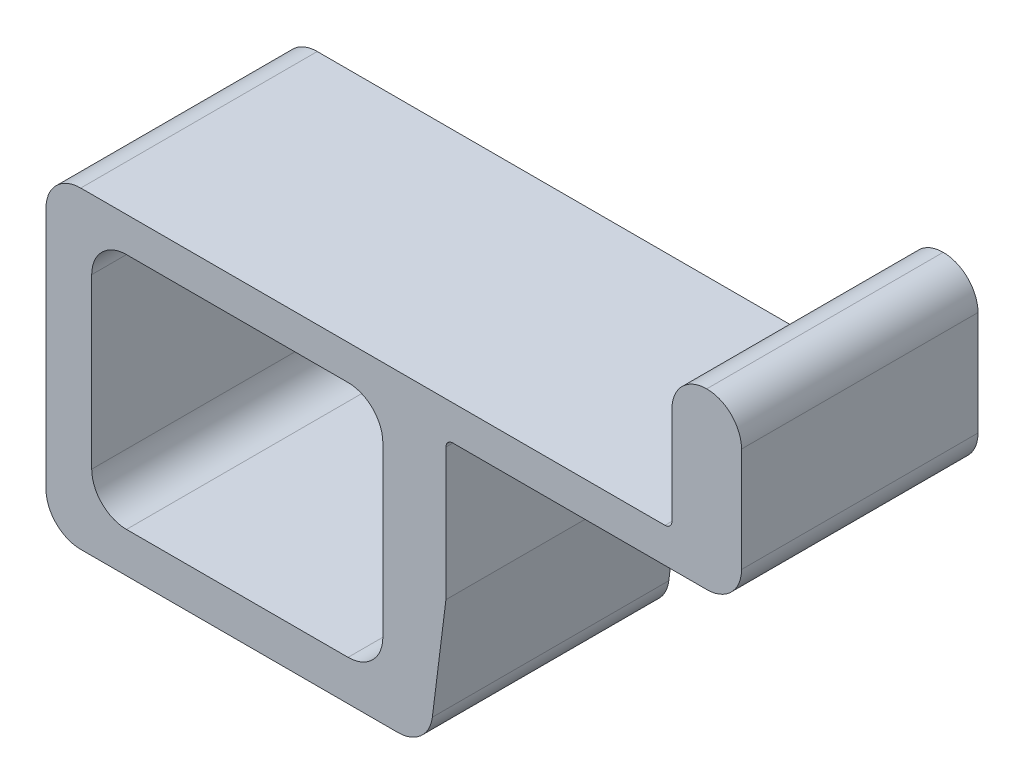
ISO-10303-21;
HEADER;
FILE_DESCRIPTION(('STEP AP214'),'2;1');
FILE_NAME('part.step','',(''),(''),'','','');
FILE_SCHEMA(('AUTOMOTIVE_DESIGN { 1 0 10303 214 1 1 1 1 }'));
ENDSEC;
DATA;
#1=APPLICATION_CONTEXT('core data for automotive mechanical design processes');
#2=APPLICATION_PROTOCOL_DEFINITION('international standard','automotive_design',2000,#1);
#3=PRODUCT_CONTEXT('',#1,'mechanical');
#4=PRODUCT('Part','Part','',(#3));
#5=PRODUCT_RELATED_PRODUCT_CATEGORY('part','',(#4));
#6=PRODUCT_DEFINITION_FORMATION('','',#4);
#7=PRODUCT_DEFINITION_CONTEXT('part definition',#1,'design');
#8=PRODUCT_DEFINITION('design','',#6,#7);
#9=PRODUCT_DEFINITION_SHAPE('','',#8);
#10=(LENGTH_UNIT() NAMED_UNIT(*) SI_UNIT(.MILLI.,.METRE.));
#11=(NAMED_UNIT(*) PLANE_ANGLE_UNIT() SI_UNIT($,.RADIAN.));
#12=(NAMED_UNIT(*) SI_UNIT($,.STERADIAN.) SOLID_ANGLE_UNIT());
#13=UNCERTAINTY_MEASURE_WITH_UNIT(LENGTH_MEASURE(1.E-05),#10,'distance_accuracy_value','');
#14=(GEOMETRIC_REPRESENTATION_CONTEXT(3) GLOBAL_UNCERTAINTY_ASSIGNED_CONTEXT((#13)) GLOBAL_UNIT_ASSIGNED_CONTEXT((#10,
#11,#12)) REPRESENTATION_CONTEXT('',''));
#15=CARTESIAN_POINT('',(0.,0.,0.));
#16=DIRECTION('',(0.,0.,1.));
#17=DIRECTION('',(1.,0.,0.));
#18=AXIS2_PLACEMENT_3D('',#15,#16,#17);
#19=CARTESIAN_POINT('',(13.9819004524887,0.,34.));
#20=DIRECTION('',(-1.,0.,0.));
#21=DIRECTION('',(0.,0.,1.));
#22=AXIS2_PLACEMENT_3D('',#19,#20,#21);
#23=PLANE('',#22);
#24=DIRECTION('',(0.,1.,0.));
#25=VECTOR('',#24,1.);
#26=CARTESIAN_POINT('',(13.9819004524887,0.,34.));
#27=LINE('',#26,#25);
#28=CARTESIAN_POINT('',(13.9819004524887,16.6108597285068,34.));
#29=VERTEX_POINT('',#28);
#30=CARTESIAN_POINT('',(13.9819004524887,30.6108597285068,34.));
#31=VERTEX_POINT('',#30);
#32=EDGE_CURVE('E391',#29,#31,#27,.T.);
#33=ORIENTED_EDGE('',*,*,#32,.T.);
#34=DIRECTION('',(0.,0.,-1.));
#35=VECTOR('',#34,1.);
#36=CARTESIAN_POINT('',(13.9819004524887,30.6108597285068,0.));
#37=LINE('',#36,#35);
#38=CARTESIAN_POINT('',(13.9819004524887,30.6108597285068,0.));
#39=VERTEX_POINT('',#38);
#40=EDGE_CURVE('E318',#31,#39,#37,.T.);
#41=ORIENTED_EDGE('',*,*,#40,.T.);
#42=DIRECTION('',(0.,1.,0.));
#43=VECTOR('',#42,1.);
#44=CARTESIAN_POINT('',(13.9819004524887,0.,0.));
#45=LINE('',#44,#43);
#46=CARTESIAN_POINT('',(13.9819004524887,16.6108597285068,0.));
#47=VERTEX_POINT('',#46);
#48=EDGE_CURVE('E244',#47,#39,#45,.T.);
#49=ORIENTED_EDGE('',*,*,#48,.F.);
#50=DIRECTION('',(0.,0.,-1.));
#51=VECTOR('',#50,1.);
#52=CARTESIAN_POINT('',(13.9819004524887,16.6108597285068,34.));
#53=LINE('',#52,#51);
#54=EDGE_CURVE('E267',#47,#29,#53,.F.);
#55=ORIENTED_EDGE('',*,*,#54,.T.);
#56=EDGE_LOOP('',(#33,#41,#49,#55));
#57=FACE_BOUND('',#56,.T.);
#58=ADVANCED_FACE('F35',(#57),#23,.T.);
#59=CARTESIAN_POINT('',(0.,15.6108597285068,34.));
#60=DIRECTION('',(0.,1.,0.));
#61=DIRECTION('',(0.,0.,1.));
#62=AXIS2_PLACEMENT_3D('',#59,#60,#61);
#63=PLANE('',#62);
#64=DIRECTION('',(1.,0.,0.));
#65=VECTOR('',#64,1.);
#66=CARTESIAN_POINT('',(0.,15.6108597285068,0.));
#67=LINE('',#66,#65);
#68=CARTESIAN_POINT('',(-71.0180995475113,15.6108597285068,0.));
#69=VERTEX_POINT('',#68);
#70=CARTESIAN_POINT('',(12.9819004524887,15.6108597285068,0.));
#71=VERTEX_POINT('',#70);
#72=EDGE_CURVE('E247',#69,#71,#67,.T.);
#73=ORIENTED_EDGE('',*,*,#72,.F.);
#74=DIRECTION('',(0.,0.,-1.));
#75=VECTOR('',#74,1.);
#76=CARTESIAN_POINT('',(-71.0180995475113,15.6108597285068,34.));
#77=LINE('',#76,#75);
#78=CARTESIAN_POINT('',(-71.0180995475113,15.6108597285068,34.));
#79=VERTEX_POINT('',#78);
#80=EDGE_CURVE('E354',#69,#79,#77,.F.);
#81=ORIENTED_EDGE('',*,*,#80,.T.);
#82=DIRECTION('',(1.,0.,0.));
#83=VECTOR('',#82,1.);
#84=CARTESIAN_POINT('',(0.,15.6108597285068,34.));
#85=LINE('',#84,#83);
#86=CARTESIAN_POINT('',(12.9819004524887,15.6108597285068,34.));
#87=VERTEX_POINT('',#86);
#88=EDGE_CURVE('E388',#79,#87,#85,.T.);
#89=ORIENTED_EDGE('',*,*,#88,.T.);
#90=DIRECTION('',(0.,0.,-1.));
#91=VECTOR('',#90,1.);
#92=CARTESIAN_POINT('',(12.9819004524887,15.6108597285068,0.));
#93=LINE('',#92,#91);
#94=EDGE_CURVE('E209',#87,#71,#93,.T.);
#95=ORIENTED_EDGE('',*,*,#94,.T.);
#96=EDGE_LOOP('',(#73,#81,#89,#95));
#97=FACE_BOUND('',#96,.T.);
#98=ADVANCED_FACE('F383',(#97),#63,.T.);
#99=CARTESIAN_POINT('',(-76.0180995475113,-4.21985222029471E-13,34.));
#100=DIRECTION('',(1.,0.,0.));
#101=DIRECTION('',(0.,1.,0.));
#102=AXIS2_PLACEMENT_3D('',#99,#100,#101);
#103=PLANE('',#102);
#104=DIRECTION('',(0.,-1.,0.));
#105=VECTOR('',#104,1.);
#106=CARTESIAN_POINT('',(-76.0180995475113,-4.21985222029471E-13,34.));
#107=LINE('',#106,#105);
#108=CARTESIAN_POINT('',(-76.0180995475113,10.6108597285068,34.));
#109=VERTEX_POINT('',#108);
#110=CARTESIAN_POINT('',(-76.0180995475111,-24.3891402714932,34.));
#111=VERTEX_POINT('',#110);
#112=EDGE_CURVE('E226',#109,#111,#107,.T.);
#113=ORIENTED_EDGE('',*,*,#112,.F.);
#114=DIRECTION('',(0.,0.,-1.));
#115=VECTOR('',#114,1.);
#116=CARTESIAN_POINT('',(-76.0180995475113,10.6108597285068,0.));
#117=LINE('',#116,#115);
#118=CARTESIAN_POINT('',(-76.0180995475113,10.6108597285068,0.));
#119=VERTEX_POINT('',#118);
#120=EDGE_CURVE('E351',#109,#119,#117,.T.);
#121=ORIENTED_EDGE('',*,*,#120,.T.);
#122=DIRECTION('',(0.,-1.,0.));
#123=VECTOR('',#122,1.);
#124=CARTESIAN_POINT('',(-76.0180995475113,-4.21985222029471E-13,0.));
#125=LINE('',#124,#123);
#126=CARTESIAN_POINT('',(-76.0180995475111,-24.3891402714932,0.));
#127=VERTEX_POINT('',#126);
#128=EDGE_CURVE('E249',#119,#127,#125,.T.);
#129=ORIENTED_EDGE('',*,*,#128,.T.);
#130=DIRECTION('',(0.,0.,-1.));
#131=VECTOR('',#130,1.);
#132=CARTESIAN_POINT('',(-76.0180995475111,-24.3891402714932,34.));
#133=LINE('',#132,#131);
#134=EDGE_CURVE('E349',#127,#111,#133,.F.);
#135=ORIENTED_EDGE('',*,*,#134,.T.);
#136=EDGE_LOOP('',(#113,#121,#129,#135));
#137=FACE_BOUND('',#136,.T.);
#138=ADVANCED_FACE('F376',(#137),#103,.F.);
#139=CARTESIAN_POINT('',(0.,-29.3891402714932,34.));
#140=DIRECTION('',(0.,1.,0.));
#141=DIRECTION('',(0.,0.,1.));
#142=AXIS2_PLACEMENT_3D('',#139,#140,#141);
#143=PLANE('',#142);
#144=DIRECTION('',(1.,0.,0.));
#145=VECTOR('',#144,1.);
#146=CARTESIAN_POINT('',(0.,-29.3891402714932,34.));
#147=LINE('',#146,#145);
#148=CARTESIAN_POINT('',(-71.0180995475111,-29.3891402714932,34.));
#149=VERTEX_POINT('',#148);
#150=CARTESIAN_POINT('',(-25.4320106401979,-29.3891402714932,34.));
#151=VERTEX_POINT('',#150);
#152=EDGE_CURVE('E224',#149,#151,#147,.T.);
#153=ORIENTED_EDGE('',*,*,#152,.F.);
#154=DIRECTION('',(0.,0.,-1.));
#155=VECTOR('',#154,1.);
#156=CARTESIAN_POINT('',(-71.0180995475111,-29.3891402714932,34.));
#157=LINE('',#156,#155);
#158=CARTESIAN_POINT('',(-71.0180995475111,-29.3891402714932,0.));
#159=VERTEX_POINT('',#158);
#160=EDGE_CURVE('E44',#149,#159,#157,.T.);
#161=ORIENTED_EDGE('',*,*,#160,.T.);
#162=DIRECTION('',(1.,0.,0.));
#163=VECTOR('',#162,1.);
#164=CARTESIAN_POINT('',(0.,-29.3891402714932,0.));
#165=LINE('',#164,#163);
#166=CARTESIAN_POINT('',(-25.4320106401979,-29.3891402714932,0.));
#167=VERTEX_POINT('',#166);
#168=EDGE_CURVE('E252',#159,#167,#165,.T.);
#169=ORIENTED_EDGE('',*,*,#168,.T.);
#170=DIRECTION('',(0.,0.,-1.));
#171=VECTOR('',#170,1.);
#172=CARTESIAN_POINT('',(-25.4320106401979,-29.3891402714932,34.));
#173=LINE('',#172,#171);
#174=EDGE_CURVE('E356',#167,#151,#173,.F.);
#175=ORIENTED_EDGE('',*,*,#174,.T.);
#176=EDGE_LOOP('',(#153,#161,#169,#175));
#177=FACE_BOUND('',#176,.T.);
#178=ADVANCED_FACE('F363',(#177),#143,.F.);
#179=CARTESIAN_POINT('',(-17.0776192133658,2.13470240167073,34.));
#180=DIRECTION('',(0.992277876713668,-0.124034734589209,0.));
#181=DIRECTION('',(0.124034734589209,0.992277876713668,0.));
#182=AXIS2_PLACEMENT_3D('',#179,#180,#181);
#183=PLANE('',#182);
#184=DIRECTION('',(-0.124034734589209,-0.992277876713668,0.));
#185=VECTOR('',#184,1.);
#186=CARTESIAN_POINT('',(-17.0776192133658,2.13470240167073,34.));
#187=LINE('',#186,#185);
#188=CARTESIAN_POINT('',(-18.5180995475113,-9.3891402714932,34.));
#189=VERTEX_POINT('',#188);
#190=CARTESIAN_POINT('',(-20.4706212566296,-25.0093139444392,34.));
#191=VERTEX_POINT('',#190);
#192=EDGE_CURVE('E202',#189,#191,#187,.T.);
#193=ORIENTED_EDGE('',*,*,#192,.T.);
#194=DIRECTION('',(0.,0.,-1.));
#195=VECTOR('',#194,1.);
#196=CARTESIAN_POINT('',(-20.4706212566296,-25.0093139444392,0.));
#197=LINE('',#196,#195);
#198=CARTESIAN_POINT('',(-20.4706212566296,-25.0093139444392,0.));
#199=VERTEX_POINT('',#198);
#200=EDGE_CURVE('E11',#191,#199,#197,.T.);
#201=ORIENTED_EDGE('',*,*,#200,.T.);
#202=DIRECTION('',(-0.124034734589209,-0.992277876713668,0.));
#203=VECTOR('',#202,1.);
#204=CARTESIAN_POINT('',(-17.0776192133658,2.13470240167073,0.));
#205=LINE('',#204,#203);
#206=CARTESIAN_POINT('',(-18.5180995475113,-9.3891402714932,0.));
#207=VERTEX_POINT('',#206);
#208=EDGE_CURVE('E205',#207,#199,#205,.T.);
#209=ORIENTED_EDGE('',*,*,#208,.F.);
#210=DIRECTION('',(0.,0.,-1.));
#211=VECTOR('',#210,1.);
#212=CARTESIAN_POINT('',(-18.5180995475113,-9.3891402714932,34.));
#213=LINE('',#212,#211);
#214=EDGE_CURVE('E198',#189,#207,#213,.T.);
#215=ORIENTED_EDGE('',*,*,#214,.F.);
#216=EDGE_LOOP('',(#193,#201,#209,#215));
#217=FACE_BOUND('',#216,.T.);
#218=ADVANCED_FACE('F200',(#217),#183,.T.);
#219=CARTESIAN_POINT('',(-18.5180995475113,0.,34.));
#220=DIRECTION('',(-1.,0.,0.));
#221=DIRECTION('',(0.,0.,1.));
#222=AXIS2_PLACEMENT_3D('',#219,#220,#221);
#223=PLANE('',#222);
#224=DIRECTION('',(0.,1.,0.));
#225=VECTOR('',#224,1.);
#226=CARTESIAN_POINT('',(-18.5180995475113,0.,0.));
#227=LINE('',#226,#225);
#228=CARTESIAN_POINT('',(-18.5180995475113,9.6108597285068,0.));
#229=VERTEX_POINT('',#228);
#230=EDGE_CURVE('E256',#207,#229,#227,.T.);
#231=ORIENTED_EDGE('',*,*,#230,.T.);
#232=DIRECTION('',(0.,0.,-1.));
#233=VECTOR('',#232,1.);
#234=CARTESIAN_POINT('',(-18.5180995475113,9.6108597285068,34.));
#235=LINE('',#234,#233);
#236=CARTESIAN_POINT('',(-18.5180995475113,9.6108597285068,34.));
#237=VERTEX_POINT('',#236);
#238=EDGE_CURVE('E216',#229,#237,#235,.F.);
#239=ORIENTED_EDGE('',*,*,#238,.T.);
#240=DIRECTION('',(0.,1.,0.));
#241=VECTOR('',#240,1.);
#242=CARTESIAN_POINT('',(-18.5180995475113,0.,34.));
#243=LINE('',#242,#241);
#244=EDGE_CURVE('E213',#189,#237,#243,.T.);
#245=ORIENTED_EDGE('',*,*,#244,.F.);
#246=ORIENTED_EDGE('',*,*,#214,.T.);
#247=EDGE_LOOP('',(#231,#239,#245,#246));
#248=FACE_BOUND('',#247,.T.);
#249=ADVANCED_FACE('F214',(#248),#223,.F.);
#250=CARTESIAN_POINT('',(0.,10.6108597285068,34.));
#251=DIRECTION('',(0.,1.,0.));
#252=DIRECTION('',(0.,0.,1.));
#253=AXIS2_PLACEMENT_3D('',#250,#251,#252);
#254=PLANE('',#253);
#255=DIRECTION('',(1.,0.,0.));
#256=VECTOR('',#255,1.);
#257=CARTESIAN_POINT('',(0.,10.6108597285068,0.));
#258=LINE('',#257,#256);
#259=CARTESIAN_POINT('',(-17.5180995475113,10.6108597285068,0.));
#260=VERTEX_POINT('',#259);
#261=CARTESIAN_POINT('',(18.9819004524886,10.6108597285068,0.));
#262=VERTEX_POINT('',#261);
#263=EDGE_CURVE('E258',#260,#262,#258,.T.);
#264=ORIENTED_EDGE('',*,*,#263,.T.);
#265=DIRECTION('',(0.,0.,-1.));
#266=VECTOR('',#265,1.);
#267=CARTESIAN_POINT('',(18.9819004524886,10.6108597285068,34.));
#268=LINE('',#267,#266);
#269=CARTESIAN_POINT('',(18.9819004524886,10.6108597285068,34.));
#270=VERTEX_POINT('',#269);
#271=EDGE_CURVE('E347',#262,#270,#268,.F.);
#272=ORIENTED_EDGE('',*,*,#271,.T.);
#273=DIRECTION('',(1.,0.,0.));
#274=VECTOR('',#273,1.);
#275=CARTESIAN_POINT('',(0.,10.6108597285068,34.));
#276=LINE('',#275,#274);
#277=CARTESIAN_POINT('',(-17.5180995475113,10.6108597285068,34.));
#278=VERTEX_POINT('',#277);
#279=EDGE_CURVE('E218',#278,#270,#276,.T.);
#280=ORIENTED_EDGE('',*,*,#279,.F.);
#281=DIRECTION('',(0.,0.,-1.));
#282=VECTOR('',#281,1.);
#283=CARTESIAN_POINT('',(-17.5180995475113,10.6108597285068,0.));
#284=LINE('',#283,#282);
#285=EDGE_CURVE('E269',#278,#260,#284,.T.);
#286=ORIENTED_EDGE('',*,*,#285,.T.);
#287=EDGE_LOOP('',(#264,#272,#280,#286));
#288=FACE_BOUND('',#287,.T.);
#289=ADVANCED_FACE('F553',(#288),#254,.F.);
#290=CARTESIAN_POINT('',(23.9819004524887,0.,34.));
#291=DIRECTION('',(1.,0.,0.));
#292=DIRECTION('',(0.,1.,0.));
#293=AXIS2_PLACEMENT_3D('',#290,#291,#292);
#294=PLANE('',#293);
#295=DIRECTION('',(0.,-1.,0.));
#296=VECTOR('',#295,1.);
#297=CARTESIAN_POINT('',(23.9819004524887,0.,0.));
#298=LINE('',#297,#296);
#299=CARTESIAN_POINT('',(23.9819004524886,30.6108597285068,0.));
#300=VERTEX_POINT('',#299);
#301=CARTESIAN_POINT('',(23.9819004524887,15.6108597285068,0.));
#302=VERTEX_POINT('',#301);
#303=EDGE_CURVE('E261',#300,#302,#298,.T.);
#304=ORIENTED_EDGE('',*,*,#303,.F.);
#305=DIRECTION('',(0.,0.,-1.));
#306=VECTOR('',#305,1.);
#307=CARTESIAN_POINT('',(23.9819004524886,30.6108597285068,34.));
#308=LINE('',#307,#306);
#309=CARTESIAN_POINT('',(23.9819004524886,30.6108597285068,34.));
#310=VERTEX_POINT('',#309);
#311=EDGE_CURVE('E345',#300,#310,#308,.F.);
#312=ORIENTED_EDGE('',*,*,#311,.T.);
#313=DIRECTION('',(0.,-1.,0.));
#314=VECTOR('',#313,1.);
#315=CARTESIAN_POINT('',(23.9819004524887,0.,34.));
#316=LINE('',#315,#314);
#317=CARTESIAN_POINT('',(23.9819004524887,15.6108597285068,34.));
#318=VERTEX_POINT('',#317);
#319=EDGE_CURVE('E210',#310,#318,#316,.T.);
#320=ORIENTED_EDGE('',*,*,#319,.T.);
#321=DIRECTION('',(0.,0.,-1.));
#322=VECTOR('',#321,1.);
#323=CARTESIAN_POINT('',(23.9819004524887,15.6108597285068,0.));
#324=LINE('',#323,#322);
#325=EDGE_CURVE('E342',#318,#302,#324,.T.);
#326=ORIENTED_EDGE('',*,*,#325,.T.);
#327=EDGE_LOOP('',(#304,#312,#320,#326));
#328=FACE_BOUND('',#327,.T.);
#329=ADVANCED_FACE('F468',(#328),#294,.T.);
#330=CARTESIAN_POINT('',(-27.5887073503891,0.,34.));
#331=DIRECTION('',(-1.,0.,0.));
#332=DIRECTION('',(0.,0.,1.));
#333=AXIS2_PLACEMENT_3D('',#330,#331,#332);
#334=PLANE('',#333);
#335=DIRECTION('',(0.,1.,0.));
#336=VECTOR('',#335,1.);
#337=CARTESIAN_POINT('',(-27.5887073503891,0.,0.));
#338=LINE('',#337,#336);
#339=CARTESIAN_POINT('',(-27.5887073503891,-18.6092868505313,0.));
#340=VERTEX_POINT('',#339);
#341=CARTESIAN_POINT('',(-27.5887073503891,5.6108597285068,0.));
#342=VERTEX_POINT('',#341);
#343=EDGE_CURVE('E232',#340,#342,#338,.T.);
#344=ORIENTED_EDGE('',*,*,#343,.F.);
#345=DIRECTION('',(0.,0.,-1.));
#346=VECTOR('',#345,1.);
#347=CARTESIAN_POINT('',(-27.5887073503891,-18.6092868505313,34.));
#348=LINE('',#347,#346);
#349=CARTESIAN_POINT('',(-27.5887073503891,-18.6092868505313,34.));
#350=VERTEX_POINT('',#349);
#351=EDGE_CURVE('E295',#340,#350,#348,.F.);
#352=ORIENTED_EDGE('',*,*,#351,.T.);
#353=DIRECTION('',(0.,1.,0.));
#354=VECTOR('',#353,1.);
#355=CARTESIAN_POINT('',(-27.5887073503891,0.,34.));
#356=LINE('',#355,#354);
#357=CARTESIAN_POINT('',(-27.5887073503891,5.6108597285068,34.));
#358=VERTEX_POINT('',#357);
#359=EDGE_CURVE('E263',#350,#358,#356,.T.);
#360=ORIENTED_EDGE('',*,*,#359,.T.);
#361=DIRECTION('',(0.,0.,-1.));
#362=VECTOR('',#361,1.);
#363=CARTESIAN_POINT('',(-27.5887073503891,5.6108597285068,34.));
#364=LINE('',#363,#362);
#365=EDGE_CURVE('E292',#358,#342,#364,.T.);
#366=ORIENTED_EDGE('',*,*,#365,.T.);
#367=EDGE_LOOP('',(#344,#352,#360,#366));
#368=FACE_BOUND('',#367,.T.);
#369=ADVANCED_FACE('F410',(#368),#334,.T.);
#370=CARTESIAN_POINT('',(0.,-23.6092868505313,34.));
#371=DIRECTION('',(0.,1.,0.));
#372=DIRECTION('',(0.,0.,1.));
#373=AXIS2_PLACEMENT_3D('',#370,#371,#372);
#374=PLANE('',#373);
#375=DIRECTION('',(1.,0.,0.));
#376=VECTOR('',#375,1.);
#377=CARTESIAN_POINT('',(0.,-23.6092868505313,0.));
#378=LINE('',#377,#376);
#379=CARTESIAN_POINT('',(-64.4474917446336,-23.6092868505313,0.));
#380=VERTEX_POINT('',#379);
#381=CARTESIAN_POINT('',(-32.5887073503891,-23.6092868505313,0.));
#382=VERTEX_POINT('',#381);
#383=EDGE_CURVE('E235',#380,#382,#378,.T.);
#384=ORIENTED_EDGE('',*,*,#383,.F.);
#385=DIRECTION('',(0.,0.,-1.));
#386=VECTOR('',#385,1.);
#387=CARTESIAN_POINT('',(-64.4474917446336,-23.6092868505313,34.));
#388=LINE('',#387,#386);
#389=CARTESIAN_POINT('',(-64.4474917446336,-23.6092868505313,34.));
#390=VERTEX_POINT('',#389);
#391=EDGE_CURVE('E290',#380,#390,#388,.F.);
#392=ORIENTED_EDGE('',*,*,#391,.T.);
#393=DIRECTION('',(1.,0.,0.));
#394=VECTOR('',#393,1.);
#395=CARTESIAN_POINT('',(0.,-23.6092868505313,34.));
#396=LINE('',#395,#394);
#397=CARTESIAN_POINT('',(-32.5887073503891,-23.6092868505313,34.));
#398=VERTEX_POINT('',#397);
#399=EDGE_CURVE('E402',#390,#398,#396,.T.);
#400=ORIENTED_EDGE('',*,*,#399,.T.);
#401=DIRECTION('',(0.,0.,-1.));
#402=VECTOR('',#401,1.);
#403=CARTESIAN_POINT('',(-32.5887073503891,-23.6092868505313,0.));
#404=LINE('',#403,#402);
#405=EDGE_CURVE('E287',#398,#382,#404,.T.);
#406=ORIENTED_EDGE('',*,*,#405,.T.);
#407=EDGE_LOOP('',(#384,#392,#400,#406));
#408=FACE_BOUND('',#407,.T.);
#409=ADVANCED_FACE('F439',(#408),#374,.T.);
#410=CARTESIAN_POINT('',(-69.4474917446336,0.,34.));
#411=DIRECTION('',(-1.,0.,0.));
#412=DIRECTION('',(0.,0.,1.));
#413=AXIS2_PLACEMENT_3D('',#410,#411,#412);
#414=PLANE('',#413);
#415=DIRECTION('',(0.,1.,0.));
#416=VECTOR('',#415,1.);
#417=CARTESIAN_POINT('',(-69.4474917446336,0.,34.));
#418=LINE('',#417,#416);
#419=CARTESIAN_POINT('',(-69.4474917446336,-18.6092868505313,34.));
#420=VERTEX_POINT('',#419);
#421=CARTESIAN_POINT('',(-69.4474917446336,5.6108597285068,34.));
#422=VERTEX_POINT('',#421);
#423=EDGE_CURVE('E399',#420,#422,#418,.T.);
#424=ORIENTED_EDGE('',*,*,#423,.F.);
#425=DIRECTION('',(0.,0.,-1.));
#426=VECTOR('',#425,1.);
#427=CARTESIAN_POINT('',(-69.4474917446336,-18.6092868505313,34.));
#428=LINE('',#427,#426);
#429=CARTESIAN_POINT('',(-69.4474917446336,-18.6092868505313,0.));
#430=VERTEX_POINT('',#429);
#431=EDGE_CURVE('E284',#420,#430,#428,.T.);
#432=ORIENTED_EDGE('',*,*,#431,.T.);
#433=DIRECTION('',(0.,1.,0.));
#434=VECTOR('',#433,1.);
#435=CARTESIAN_POINT('',(-69.4474917446336,0.,0.));
#436=LINE('',#435,#434);
#437=CARTESIAN_POINT('',(-69.4474917446336,5.6108597285068,0.));
#438=VERTEX_POINT('',#437);
#439=EDGE_CURVE('E238',#430,#438,#436,.T.);
#440=ORIENTED_EDGE('',*,*,#439,.T.);
#441=DIRECTION('',(0.,0.,-1.));
#442=VECTOR('',#441,1.);
#443=CARTESIAN_POINT('',(-69.4474917446336,5.6108597285068,34.));
#444=LINE('',#443,#442);
#445=EDGE_CURVE('E282',#438,#422,#444,.F.);
#446=ORIENTED_EDGE('',*,*,#445,.T.);
#447=EDGE_LOOP('',(#424,#432,#440,#446));
#448=FACE_BOUND('',#447,.T.);
#449=ADVANCED_FACE('F431',(#448),#414,.F.);
#450=CARTESIAN_POINT('',(0.,10.6108597285068,34.));
#451=DIRECTION('',(0.,1.,0.));
#452=DIRECTION('',(0.,0.,1.));
#453=AXIS2_PLACEMENT_3D('',#450,#451,#452);
#454=PLANE('',#453);
#455=DIRECTION('',(1.,0.,0.));
#456=VECTOR('',#455,1.);
#457=CARTESIAN_POINT('',(0.,10.6108597285068,0.));
#458=LINE('',#457,#456);
#459=CARTESIAN_POINT('',(-64.4474917446336,10.6108597285068,0.));
#460=VERTEX_POINT('',#459);
#461=CARTESIAN_POINT('',(-32.5887073503891,10.6108597285068,0.));
#462=VERTEX_POINT('',#461);
#463=EDGE_CURVE('E241',#460,#462,#458,.T.);
#464=ORIENTED_EDGE('',*,*,#463,.T.);
#465=DIRECTION('',(0.,0.,-1.));
#466=VECTOR('',#465,1.);
#467=CARTESIAN_POINT('',(-32.5887073503891,10.6108597285068,34.));
#468=LINE('',#467,#466);
#469=CARTESIAN_POINT('',(-32.5887073503891,10.6108597285068,34.));
#470=VERTEX_POINT('',#469);
#471=EDGE_CURVE('E300',#462,#470,#468,.F.);
#472=ORIENTED_EDGE('',*,*,#471,.T.);
#473=DIRECTION('',(1.,0.,0.));
#474=VECTOR('',#473,1.);
#475=CARTESIAN_POINT('',(0.,10.6108597285068,34.));
#476=LINE('',#475,#474);
#477=CARTESIAN_POINT('',(-64.4474917446336,10.6108597285068,34.));
#478=VERTEX_POINT('',#477);
#479=EDGE_CURVE('E394',#478,#470,#476,.T.);
#480=ORIENTED_EDGE('',*,*,#479,.F.);
#481=DIRECTION('',(0.,0.,-1.));
#482=VECTOR('',#481,1.);
#483=CARTESIAN_POINT('',(-64.4474917446336,10.6108597285068,0.));
#484=LINE('',#483,#482);
#485=EDGE_CURVE('E297',#478,#460,#484,.T.);
#486=ORIENTED_EDGE('',*,*,#485,.T.);
#487=EDGE_LOOP('',(#464,#472,#480,#486));
#488=FACE_BOUND('',#487,.T.);
#489=ADVANCED_FACE('F421',(#488),#454,.F.);
#490=CARTESIAN_POINT('',(0.,0.,34.));
#491=DIRECTION('',(0.,0.,1.));
#492=DIRECTION('',(1.,0.,0.));
#493=AXIS2_PLACEMENT_3D('',#490,#491,#492);
#494=PLANE('',#493);
#495=ORIENTED_EDGE('',*,*,#359,.F.);
#496=CARTESIAN_POINT('',(-32.5887073503891,-18.6092868505313,34.));
#497=DIRECTION('',(0.,0.,1.));
#498=DIRECTION('',(1.,0.,0.));
#499=AXIS2_PLACEMENT_3D('',#496,#497,#498);
#500=CIRCLE('',#499,5.);
#501=EDGE_CURVE('E308',#350,#398,#500,.F.);
#502=ORIENTED_EDGE('',*,*,#501,.T.);
#503=ORIENTED_EDGE('',*,*,#399,.F.);
#504=CARTESIAN_POINT('',(-64.4474917446336,-18.6092868505313,34.));
#505=DIRECTION('',(0.,0.,1.));
#506=DIRECTION('',(1.,0.,0.));
#507=AXIS2_PLACEMENT_3D('',#504,#505,#506);
#508=CIRCLE('',#507,5.);
#509=EDGE_CURVE('E304',#390,#420,#508,.F.);
#510=ORIENTED_EDGE('',*,*,#509,.T.);
#511=ORIENTED_EDGE('',*,*,#423,.T.);
#512=CARTESIAN_POINT('',(-64.4474917446336,5.6108597285068,34.));
#513=DIRECTION('',(0.,0.,1.));
#514=DIRECTION('',(1.,0.,0.));
#515=AXIS2_PLACEMENT_3D('',#512,#513,#514);
#516=CIRCLE('',#515,5.);
#517=EDGE_CURVE('E316',#422,#478,#516,.F.);
#518=ORIENTED_EDGE('',*,*,#517,.T.);
#519=ORIENTED_EDGE('',*,*,#479,.T.);
#520=CARTESIAN_POINT('',(-32.5887073503891,5.6108597285068,34.));
#521=DIRECTION('',(0.,0.,1.));
#522=DIRECTION('',(1.,0.,0.));
#523=AXIS2_PLACEMENT_3D('',#520,#521,#522);
#524=CIRCLE('',#523,5.);
#525=EDGE_CURVE('E312',#470,#358,#524,.F.);
#526=ORIENTED_EDGE('',*,*,#525,.T.);
#527=EDGE_LOOP('',(#495,#502,#503,#510,#511,#518,#519,#526));
#528=FACE_BOUND('',#527,.T.);
#529=CARTESIAN_POINT('',(18.9819004524886,30.6108597285068,34.));
#530=DIRECTION('',(0.,0.,1.));
#531=DIRECTION('',(1.,0.,0.));
#532=AXIS2_PLACEMENT_3D('',#529,#530,#531);
#533=CIRCLE('',#532,5.);
#534=CARTESIAN_POINT('',(18.9819004524886,35.6108597285068,34.));
#535=VERTEX_POINT('',#534);
#536=EDGE_CURVE('E51',#310,#535,#533,.T.);
#537=ORIENTED_EDGE('',*,*,#536,.T.);
#538=CARTESIAN_POINT('',(18.9819004524886,30.6108597285068,34.));
#539=DIRECTION('',(0.,0.,1.));
#540=DIRECTION('',(1.,0.,0.));
#541=AXIS2_PLACEMENT_3D('',#538,#539,#540);
#542=CIRCLE('',#541,5.);
#543=EDGE_CURVE('E340',#535,#31,#542,.T.);
#544=ORIENTED_EDGE('',*,*,#543,.T.);
#545=ORIENTED_EDGE('',*,*,#32,.F.);
#546=CARTESIAN_POINT('',(12.9819004524887,16.6108597285068,34.));
#547=DIRECTION('',(0.,0.,1.));
#548=DIRECTION('',(1.,0.,0.));
#549=AXIS2_PLACEMENT_3D('',#546,#547,#548);
#550=CIRCLE('',#549,1.);
#551=EDGE_CURVE('E275',#29,#87,#550,.F.);
#552=ORIENTED_EDGE('',*,*,#551,.T.);
#553=ORIENTED_EDGE('',*,*,#88,.F.);
#554=CARTESIAN_POINT('',(-71.0180995475113,10.6108597285068,34.));
#555=DIRECTION('',(0.,0.,1.));
#556=DIRECTION('',(1.,0.,0.));
#557=AXIS2_PLACEMENT_3D('',#554,#555,#556);
#558=CIRCLE('',#557,5.);
#559=EDGE_CURVE('E336',#79,#109,#558,.T.);
#560=ORIENTED_EDGE('',*,*,#559,.T.);
#561=ORIENTED_EDGE('',*,*,#112,.T.);
#562=CARTESIAN_POINT('',(-71.0180995475111,-24.3891402714932,34.));
#563=DIRECTION('',(0.,0.,1.));
#564=DIRECTION('',(1.,0.,0.));
#565=AXIS2_PLACEMENT_3D('',#562,#563,#564);
#566=CIRCLE('',#565,5.);
#567=EDGE_CURVE('E334',#111,#149,#566,.T.);
#568=ORIENTED_EDGE('',*,*,#567,.T.);
#569=ORIENTED_EDGE('',*,*,#152,.T.);
#570=CARTESIAN_POINT('',(-25.4320106401979,-24.3891402714932,34.));
#571=DIRECTION('',(0.,0.,1.));
#572=DIRECTION('',(1.,0.,0.));
#573=AXIS2_PLACEMENT_3D('',#570,#571,#572);
#574=CIRCLE('',#573,5.);
#575=EDGE_CURVE('E223',#151,#191,#574,.T.);
#576=ORIENTED_EDGE('',*,*,#575,.T.);
#577=ORIENTED_EDGE('',*,*,#192,.F.);
#578=ORIENTED_EDGE('',*,*,#244,.T.);
#579=CARTESIAN_POINT('',(-17.5180995475113,9.6108597285068,34.));
#580=DIRECTION('',(0.,0.,1.));
#581=DIRECTION('',(1.,0.,0.));
#582=AXIS2_PLACEMENT_3D('',#579,#580,#581);
#583=CIRCLE('',#582,1.);
#584=EDGE_CURVE('E280',#237,#278,#583,.F.);
#585=ORIENTED_EDGE('',*,*,#584,.T.);
#586=ORIENTED_EDGE('',*,*,#279,.T.);
#587=CARTESIAN_POINT('',(18.9819004524886,15.6108597285068,34.));
#588=DIRECTION('',(0.,0.,1.));
#589=DIRECTION('',(1.,0.,0.));
#590=AXIS2_PLACEMENT_3D('',#587,#588,#589);
#591=CIRCLE('',#590,5.);
#592=EDGE_CURVE('E57',#270,#318,#591,.T.);
#593=ORIENTED_EDGE('',*,*,#592,.T.);
#594=ORIENTED_EDGE('',*,*,#319,.F.);
#595=EDGE_LOOP('',(#537,#544,#545,#552,#553,#560,#561,#568,#569,#576,#577,#578,#585,#586,#593,#594));
#596=FACE_BOUND('',#595,.T.);
#597=ADVANCED_FACE('F220',(#528,#596),#494,.T.);
#598=CARTESIAN_POINT('',(0.,0.,0.));
#599=DIRECTION('',(0.,0.,1.));
#600=DIRECTION('',(1.,0.,0.));
#601=AXIS2_PLACEMENT_3D('',#598,#599,#600);
#602=PLANE('',#601);
#603=ORIENTED_EDGE('',*,*,#383,.T.);
#604=CARTESIAN_POINT('',(-32.5887073503891,-18.6092868505313,0.));
#605=DIRECTION('',(0.,0.,1.));
#606=DIRECTION('',(1.,0.,0.));
#607=AXIS2_PLACEMENT_3D('',#604,#605,#606);
#608=CIRCLE('',#607,5.);
#609=EDGE_CURVE('E306',#382,#340,#608,.T.);
#610=ORIENTED_EDGE('',*,*,#609,.T.);
#611=ORIENTED_EDGE('',*,*,#343,.T.);
#612=CARTESIAN_POINT('',(-32.5887073503891,5.6108597285068,0.));
#613=DIRECTION('',(0.,0.,1.));
#614=DIRECTION('',(1.,0.,0.));
#615=AXIS2_PLACEMENT_3D('',#612,#613,#614);
#616=CIRCLE('',#615,5.);
#617=EDGE_CURVE('E310',#342,#462,#616,.T.);
#618=ORIENTED_EDGE('',*,*,#617,.T.);
#619=ORIENTED_EDGE('',*,*,#463,.F.);
#620=CARTESIAN_POINT('',(-64.4474917446336,5.6108597285068,0.));
#621=DIRECTION('',(0.,0.,1.));
#622=DIRECTION('',(1.,0.,0.));
#623=AXIS2_PLACEMENT_3D('',#620,#621,#622);
#624=CIRCLE('',#623,5.);
#625=EDGE_CURVE('E314',#460,#438,#624,.T.);
#626=ORIENTED_EDGE('',*,*,#625,.T.);
#627=ORIENTED_EDGE('',*,*,#439,.F.);
#628=CARTESIAN_POINT('',(-64.4474917446336,-18.6092868505313,0.));
#629=DIRECTION('',(0.,0.,1.));
#630=DIRECTION('',(1.,0.,0.));
#631=AXIS2_PLACEMENT_3D('',#628,#629,#630);
#632=CIRCLE('',#631,5.);
#633=EDGE_CURVE('E302',#430,#380,#632,.T.);
#634=ORIENTED_EDGE('',*,*,#633,.T.);
#635=EDGE_LOOP('',(#603,#610,#611,#618,#619,#626,#627,#634));
#636=FACE_BOUND('',#635,.T.);
#637=ORIENTED_EDGE('',*,*,#48,.T.);
#638=CARTESIAN_POINT('',(18.9819004524886,30.6108597285068,0.));
#639=DIRECTION('',(0.,0.,1.));
#640=DIRECTION('',(1.,0.,0.));
#641=AXIS2_PLACEMENT_3D('',#638,#639,#640);
#642=CIRCLE('',#641,5.);
#643=CARTESIAN_POINT('',(18.9819004524886,35.6108597285068,0.));
#644=VERTEX_POINT('',#643);
#645=EDGE_CURVE('E331',#39,#644,#642,.F.);
#646=ORIENTED_EDGE('',*,*,#645,.T.);
#647=CARTESIAN_POINT('',(18.9819004524886,30.6108597285068,0.));
#648=DIRECTION('',(0.,0.,1.));
#649=DIRECTION('',(1.,0.,0.));
#650=AXIS2_PLACEMENT_3D('',#647,#648,#649);
#651=CIRCLE('',#650,5.);
#652=EDGE_CURVE('E329',#644,#300,#651,.F.);
#653=ORIENTED_EDGE('',*,*,#652,.T.);
#654=ORIENTED_EDGE('',*,*,#303,.T.);
#655=CARTESIAN_POINT('',(18.9819004524886,15.6108597285068,0.));
#656=DIRECTION('',(0.,0.,1.));
#657=DIRECTION('',(1.,0.,0.));
#658=AXIS2_PLACEMENT_3D('',#655,#656,#657);
#659=CIRCLE('',#658,5.);
#660=EDGE_CURVE('E327',#302,#262,#659,.F.);
#661=ORIENTED_EDGE('',*,*,#660,.T.);
#662=ORIENTED_EDGE('',*,*,#263,.F.);
#663=CARTESIAN_POINT('',(-17.5180995475113,9.6108597285068,0.));
#664=DIRECTION('',(0.,0.,1.));
#665=DIRECTION('',(1.,0.,0.));
#666=AXIS2_PLACEMENT_3D('',#663,#664,#665);
#667=CIRCLE('',#666,1.);
#668=EDGE_CURVE('E278',#260,#229,#667,.T.);
#669=ORIENTED_EDGE('',*,*,#668,.T.);
#670=ORIENTED_EDGE('',*,*,#230,.F.);
#671=ORIENTED_EDGE('',*,*,#208,.T.);
#672=CARTESIAN_POINT('',(-25.4320106401979,-24.3891402714932,0.));
#673=DIRECTION('',(0.,0.,1.));
#674=DIRECTION('',(1.,0.,0.));
#675=AXIS2_PLACEMENT_3D('',#672,#673,#674);
#676=CIRCLE('',#675,5.);
#677=EDGE_CURVE('E321',#199,#167,#676,.F.);
#678=ORIENTED_EDGE('',*,*,#677,.T.);
#679=ORIENTED_EDGE('',*,*,#168,.F.);
#680=CARTESIAN_POINT('',(-71.0180995475111,-24.3891402714932,0.));
#681=DIRECTION('',(0.,0.,1.));
#682=DIRECTION('',(1.,0.,0.));
#683=AXIS2_PLACEMENT_3D('',#680,#681,#682);
#684=CIRCLE('',#683,5.);
#685=EDGE_CURVE('E323',#159,#127,#684,.F.);
#686=ORIENTED_EDGE('',*,*,#685,.T.);
#687=ORIENTED_EDGE('',*,*,#128,.F.);
#688=CARTESIAN_POINT('',(-71.0180995475113,10.6108597285068,0.));
#689=DIRECTION('',(0.,0.,1.));
#690=DIRECTION('',(1.,0.,0.));
#691=AXIS2_PLACEMENT_3D('',#688,#689,#690);
#692=CIRCLE('',#691,5.);
#693=EDGE_CURVE('E325',#119,#69,#692,.F.);
#694=ORIENTED_EDGE('',*,*,#693,.T.);
#695=ORIENTED_EDGE('',*,*,#72,.T.);
#696=CARTESIAN_POINT('',(12.9819004524887,16.6108597285068,0.));
#697=DIRECTION('',(0.,0.,1.));
#698=DIRECTION('',(1.,0.,0.));
#699=AXIS2_PLACEMENT_3D('',#696,#697,#698);
#700=CIRCLE('',#699,1.);
#701=EDGE_CURVE('E273',#71,#47,#700,.T.);
#702=ORIENTED_EDGE('',*,*,#701,.T.);
#703=EDGE_LOOP('',(#637,#646,#653,#654,#661,#662,#669,#670,#671,#678,#679,#686,#687,#694,#695,#702));
#704=FACE_BOUND('',#703,.T.);
#705=ADVANCED_FACE('F368',(#636,#704),#602,.F.);
#706=CARTESIAN_POINT('',(12.9819004524887,16.6108597285068,34.));
#707=DIRECTION('',(0.,0.,1.));
#708=DIRECTION('',(1.,0.,0.));
#709=AXIS2_PLACEMENT_3D('',#706,#707,#708);
#710=CYLINDRICAL_SURFACE('',#709,1.);
#711=ORIENTED_EDGE('',*,*,#551,.F.);
#712=ORIENTED_EDGE('',*,*,#54,.F.);
#713=ORIENTED_EDGE('',*,*,#701,.F.);
#714=ORIENTED_EDGE('',*,*,#94,.F.);
#715=EDGE_LOOP('',(#711,#712,#713,#714));
#716=FACE_BOUND('',#715,.T.);
#717=ADVANCED_FACE('F450',(#716),#710,.F.);
#718=CARTESIAN_POINT('',(-17.5180995475113,9.6108597285068,34.));
#719=DIRECTION('',(0.,0.,1.));
#720=DIRECTION('',(1.,0.,0.));
#721=AXIS2_PLACEMENT_3D('',#718,#719,#720);
#722=CYLINDRICAL_SURFACE('',#721,1.);
#723=ORIENTED_EDGE('',*,*,#584,.F.);
#724=ORIENTED_EDGE('',*,*,#238,.F.);
#725=ORIENTED_EDGE('',*,*,#668,.F.);
#726=ORIENTED_EDGE('',*,*,#285,.F.);
#727=EDGE_LOOP('',(#723,#724,#725,#726));
#728=FACE_BOUND('',#727,.T.);
#729=ADVANCED_FACE('F471',(#728),#722,.F.);
#730=CARTESIAN_POINT('',(-64.4474917446336,-18.6092868505313,34.));
#731=DIRECTION('',(0.,0.,-1.));
#732=DIRECTION('',(-1.,0.,0.));
#733=AXIS2_PLACEMENT_3D('',#730,#731,#732);
#734=CYLINDRICAL_SURFACE('',#733,5.);
#735=ORIENTED_EDGE('',*,*,#509,.F.);
#736=ORIENTED_EDGE('',*,*,#391,.F.);
#737=ORIENTED_EDGE('',*,*,#633,.F.);
#738=ORIENTED_EDGE('',*,*,#431,.F.);
#739=EDGE_LOOP('',(#735,#736,#737,#738));
#740=FACE_BOUND('',#739,.T.);
#741=ADVANCED_FACE('F435',(#740),#734,.F.);
#742=CARTESIAN_POINT('',(-32.5887073503891,-18.6092868505313,34.));
#743=DIRECTION('',(0.,0.,1.));
#744=DIRECTION('',(1.,0.,0.));
#745=AXIS2_PLACEMENT_3D('',#742,#743,#744);
#746=CYLINDRICAL_SURFACE('',#745,5.);
#747=ORIENTED_EDGE('',*,*,#501,.F.);
#748=ORIENTED_EDGE('',*,*,#351,.F.);
#749=ORIENTED_EDGE('',*,*,#609,.F.);
#750=ORIENTED_EDGE('',*,*,#405,.F.);
#751=EDGE_LOOP('',(#747,#748,#749,#750));
#752=FACE_BOUND('',#751,.T.);
#753=ADVANCED_FACE('F443',(#752),#746,.F.);
#754=CARTESIAN_POINT('',(-32.5887073503891,5.6108597285068,34.));
#755=DIRECTION('',(0.,0.,-1.));
#756=DIRECTION('',(-1.,0.,0.));
#757=AXIS2_PLACEMENT_3D('',#754,#755,#756);
#758=CYLINDRICAL_SURFACE('',#757,5.);
#759=ORIENTED_EDGE('',*,*,#525,.F.);
#760=ORIENTED_EDGE('',*,*,#471,.F.);
#761=ORIENTED_EDGE('',*,*,#617,.F.);
#762=ORIENTED_EDGE('',*,*,#365,.F.);
#763=EDGE_LOOP('',(#759,#760,#761,#762));
#764=FACE_BOUND('',#763,.T.);
#765=ADVANCED_FACE('F416',(#764),#758,.F.);
#766=CARTESIAN_POINT('',(-64.4474917446336,5.6108597285068,34.));
#767=DIRECTION('',(0.,0.,1.));
#768=DIRECTION('',(1.,0.,0.));
#769=AXIS2_PLACEMENT_3D('',#766,#767,#768);
#770=CYLINDRICAL_SURFACE('',#769,5.);
#771=ORIENTED_EDGE('',*,*,#517,.F.);
#772=ORIENTED_EDGE('',*,*,#445,.F.);
#773=ORIENTED_EDGE('',*,*,#625,.F.);
#774=ORIENTED_EDGE('',*,*,#485,.F.);
#775=EDGE_LOOP('',(#771,#772,#773,#774));
#776=FACE_BOUND('',#775,.T.);
#777=ADVANCED_FACE('F426',(#776),#770,.F.);
#778=CARTESIAN_POINT('',(18.9819004524886,30.6108597285068,34.));
#779=DIRECTION('',(0.,0.,1.));
#780=DIRECTION('',(1.,0.,0.));
#781=AXIS2_PLACEMENT_3D('',#778,#779,#780);
#782=CYLINDRICAL_SURFACE('',#781,5.);
#783=DIRECTION('',(0.,0.,-1.));
#784=VECTOR('',#783,1.);
#785=CARTESIAN_POINT('',(18.9819004524886,35.6108597285068,0.));
#786=LINE('',#785,#784);
#787=EDGE_CURVE('E39',#535,#644,#786,.T.);
#788=ORIENTED_EDGE('',*,*,#787,.F.);
#789=ORIENTED_EDGE('',*,*,#536,.F.);
#790=ORIENTED_EDGE('',*,*,#311,.F.);
#791=ORIENTED_EDGE('',*,*,#652,.F.);
#792=EDGE_LOOP('',(#788,#789,#790,#791));
#793=FACE_BOUND('',#792,.T.);
#794=ADVANCED_FACE('F484',(#793),#782,.T.);
#795=CARTESIAN_POINT('',(18.9819004524886,30.6108597285068,34.));
#796=DIRECTION('',(0.,0.,1.));
#797=DIRECTION('',(1.,0.,0.));
#798=AXIS2_PLACEMENT_3D('',#795,#796,#797);
#799=CYLINDRICAL_SURFACE('',#798,5.);
#800=ORIENTED_EDGE('',*,*,#543,.F.);
#801=ORIENTED_EDGE('',*,*,#787,.T.);
#802=ORIENTED_EDGE('',*,*,#645,.F.);
#803=ORIENTED_EDGE('',*,*,#40,.F.);
#804=EDGE_LOOP('',(#800,#801,#802,#803));
#805=FACE_BOUND('',#804,.T.);
#806=ADVANCED_FACE('F485',(#805),#799,.T.);
#807=CARTESIAN_POINT('',(18.9819004524886,15.6108597285068,34.));
#808=DIRECTION('',(0.,0.,1.));
#809=DIRECTION('',(1.,0.,0.));
#810=AXIS2_PLACEMENT_3D('',#807,#808,#809);
#811=CYLINDRICAL_SURFACE('',#810,5.);
#812=ORIENTED_EDGE('',*,*,#592,.F.);
#813=ORIENTED_EDGE('',*,*,#271,.F.);
#814=ORIENTED_EDGE('',*,*,#660,.F.);
#815=ORIENTED_EDGE('',*,*,#325,.F.);
#816=EDGE_LOOP('',(#812,#813,#814,#815));
#817=FACE_BOUND('',#816,.T.);
#818=ADVANCED_FACE('F488',(#817),#811,.T.);
#819=CARTESIAN_POINT('',(-71.0180995475113,10.6108597285068,34.));
#820=DIRECTION('',(0.,0.,1.));
#821=DIRECTION('',(1.,0.,0.));
#822=AXIS2_PLACEMENT_3D('',#819,#820,#821);
#823=CYLINDRICAL_SURFACE('',#822,5.);
#824=ORIENTED_EDGE('',*,*,#559,.F.);
#825=ORIENTED_EDGE('',*,*,#80,.F.);
#826=ORIENTED_EDGE('',*,*,#693,.F.);
#827=ORIENTED_EDGE('',*,*,#120,.F.);
#828=EDGE_LOOP('',(#824,#825,#826,#827));
#829=FACE_BOUND('',#828,.T.);
#830=ADVANCED_FACE('F387',(#829),#823,.T.);
#831=CARTESIAN_POINT('',(-71.0180995475111,-24.3891402714932,34.));
#832=DIRECTION('',(0.,0.,-1.));
#833=DIRECTION('',(-1.,0.,0.));
#834=AXIS2_PLACEMENT_3D('',#831,#832,#833);
#835=CYLINDRICAL_SURFACE('',#834,5.);
#836=ORIENTED_EDGE('',*,*,#567,.F.);
#837=ORIENTED_EDGE('',*,*,#134,.F.);
#838=ORIENTED_EDGE('',*,*,#685,.F.);
#839=ORIENTED_EDGE('',*,*,#160,.F.);
#840=EDGE_LOOP('',(#836,#837,#838,#839));
#841=FACE_BOUND('',#840,.T.);
#842=ADVANCED_FACE('F374',(#841),#835,.T.);
#843=CARTESIAN_POINT('',(-25.4320106401979,-24.3891402714932,34.));
#844=DIRECTION('',(0.,0.,1.));
#845=DIRECTION('',(1.,0.,0.));
#846=AXIS2_PLACEMENT_3D('',#843,#844,#845);
#847=CYLINDRICAL_SURFACE('',#846,5.);
#848=ORIENTED_EDGE('',*,*,#575,.F.);
#849=ORIENTED_EDGE('',*,*,#174,.F.);
#850=ORIENTED_EDGE('',*,*,#677,.F.);
#851=ORIENTED_EDGE('',*,*,#200,.F.);
#852=EDGE_LOOP('',(#848,#849,#850,#851));
#853=FACE_BOUND('',#852,.T.);
#854=ADVANCED_FACE('F37',(#853),#847,.T.);
#855=CLOSED_SHELL('',(#58,#98,#138,#178,#218,#249,#289,#329,#369,#409,#449,#489,#597,#705,#717,
#729,#741,#753,#765,#777,#794,#806,#818,#830,#842,#854));
#856=MANIFOLD_SOLID_BREP('B2',#855);
#857=ADVANCED_BREP_SHAPE_REPRESENTATION('',(#18,#856),#14);
#858=SHAPE_DEFINITION_REPRESENTATION(#9,#857);
ENDSEC;
END-ISO-10303-21;
